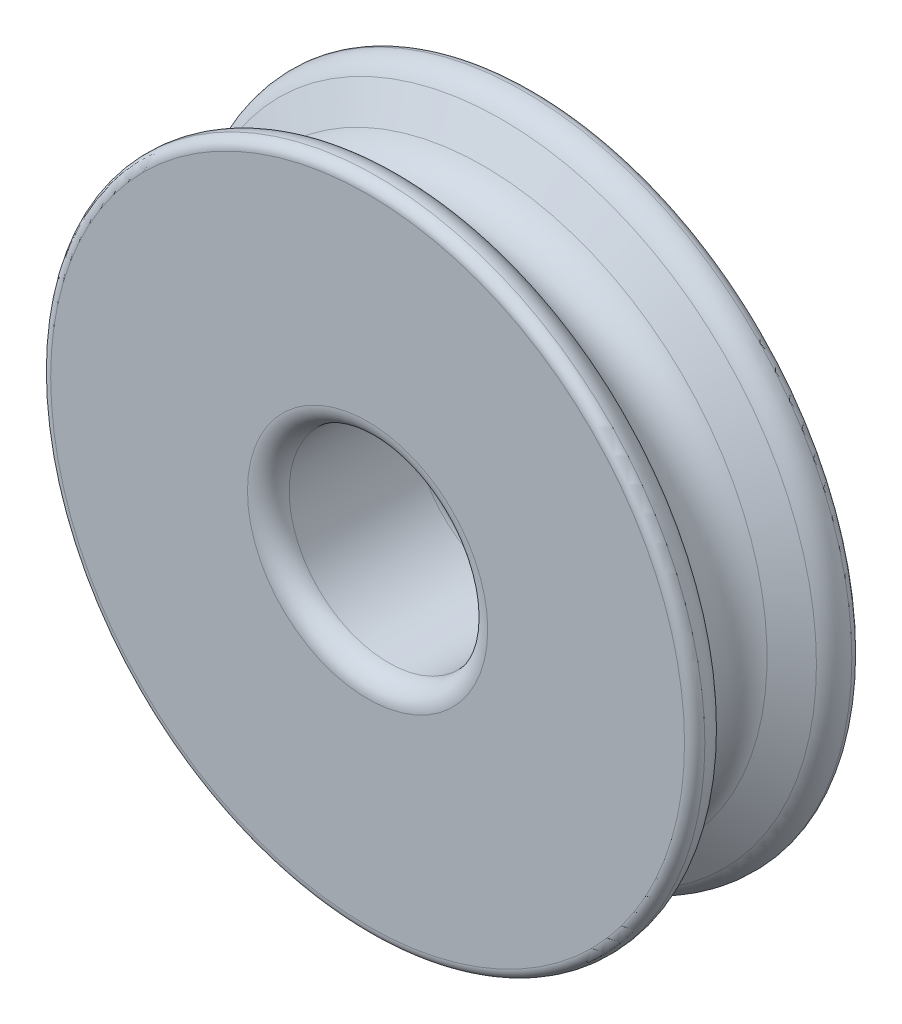
ISO-10303-21;
HEADER;
FILE_DESCRIPTION(('STEP AP214'),'2;1');
FILE_NAME('part.step','',(''),(''),'','','');
FILE_SCHEMA(('AUTOMOTIVE_DESIGN { 1 0 10303 214 1 1 1 1 }'));
ENDSEC;
DATA;
#1=APPLICATION_CONTEXT('core data for automotive mechanical design processes');
#2=APPLICATION_PROTOCOL_DEFINITION('international standard','automotive_design',2000,#1);
#3=PRODUCT_CONTEXT('',#1,'mechanical');
#4=PRODUCT('Part','Part','',(#3));
#5=PRODUCT_RELATED_PRODUCT_CATEGORY('part','',(#4));
#6=PRODUCT_DEFINITION_FORMATION('','',#4);
#7=PRODUCT_DEFINITION_CONTEXT('part definition',#1,'design');
#8=PRODUCT_DEFINITION('design','',#6,#7);
#9=PRODUCT_DEFINITION_SHAPE('','',#8);
#10=(LENGTH_UNIT() NAMED_UNIT(*) SI_UNIT(.MILLI.,.METRE.));
#11=(NAMED_UNIT(*) PLANE_ANGLE_UNIT() SI_UNIT($,.RADIAN.));
#12=(NAMED_UNIT(*) SI_UNIT($,.STERADIAN.) SOLID_ANGLE_UNIT());
#13=UNCERTAINTY_MEASURE_WITH_UNIT(LENGTH_MEASURE(1.E-05),#10,'distance_accuracy_value','');
#14=(GEOMETRIC_REPRESENTATION_CONTEXT(3) GLOBAL_UNCERTAINTY_ASSIGNED_CONTEXT((#13)) GLOBAL_UNIT_ASSIGNED_CONTEXT((#10,
#11,#12)) REPRESENTATION_CONTEXT('',''));
#15=CARTESIAN_POINT('',(0.,0.,0.));
#16=DIRECTION('',(0.,0.,1.));
#17=DIRECTION('',(1.,0.,0.));
#18=AXIS2_PLACEMENT_3D('',#15,#16,#17);
#19=CARTESIAN_POINT('',(0.,0.,-3.5));
#20=DIRECTION('',(0.,0.,-1.));
#21=DIRECTION('',(-1.,0.,0.));
#22=AXIS2_PLACEMENT_3D('',#19,#20,#21);
#23=TOROIDAL_SURFACE('',#22,15.2006264756117,0.499999999999999);
#24=CARTESIAN_POINT('',(0.,0.,-3.52502165342211));
#25=DIRECTION('',(0.,0.,-1.));
#26=DIRECTION('',(-1.,0.,0.));
#27=AXIS2_PLACEMENT_3D('',#24,#25,#26);
#28=CIRCLE('',#27,15.7);
#29=CARTESIAN_POINT('',(-15.7,0.,-3.52502165342211));
#30=VERTEX_POINT('',#29);
#31=EDGE_CURVE('E50',#30,#30,#28,.T.);
#32=ORIENTED_EDGE('',*,*,#31,.T.);
#33=EDGE_LOOP('',(#32));
#34=FACE_BOUND('',#33,.T.);
#35=CARTESIAN_POINT('',(0.,0.,-4.));
#36=DIRECTION('',(0.,0.,-1.));
#37=DIRECTION('',(-1.,0.,0.));
#38=AXIS2_PLACEMENT_3D('',#35,#36,#37);
#39=CIRCLE('',#38,15.2006264756117);
#40=CARTESIAN_POINT('',(-15.2006264756117,0.,-4.));
#41=VERTEX_POINT('',#40);
#42=EDGE_CURVE('E71',#41,#41,#39,.T.);
#43=ORIENTED_EDGE('',*,*,#42,.F.);
#44=EDGE_LOOP('',(#43));
#45=FACE_BOUND('',#44,.T.);
#46=ADVANCED_FACE('F30',(#34,#45),#23,.T.);
#47=CARTESIAN_POINT('',(0.,0.,-3.46496968520905));
#48=DIRECTION('',(0.,0.,-1.));
#49=DIRECTION('',(-1.,0.,0.));
#50=AXIS2_PLACEMENT_3D('',#47,#48,#49);
#51=TOROIDAL_SURFACE('',#50,14.501503541468,1.2);
#52=CARTESIAN_POINT('',(0.,0.,-2.42573920066772));
#53=DIRECTION('',(0.,0.,-1.));
#54=DIRECTION('',(-1.,0.,0.));
#55=AXIS2_PLACEMENT_3D('',#52,#53,#54);
#56=CIRCLE('',#55,15.101503541468);
#57=CARTESIAN_POINT('',(-15.101503541468,0.,-2.42573920066772));
#58=VERTEX_POINT('',#57);
#59=EDGE_CURVE('E53',#58,#58,#56,.T.);
#60=ORIENTED_EDGE('',*,*,#59,.T.);
#61=EDGE_LOOP('',(#60));
#62=FACE_BOUND('',#61,.T.);
#63=ORIENTED_EDGE('',*,*,#31,.F.);
#64=EDGE_LOOP('',(#63));
#65=FACE_BOUND('',#64,.T.);
#66=ADVANCED_FACE('F78',(#62,#65),#51,.T.);
#67=CARTESIAN_POINT('',(0.,0.,-2.42573920066772));
#68=DIRECTION('',(0.,0.,-1.));
#69=DIRECTION('',(-1.,0.,0.));
#70=AXIS2_PLACEMENT_3D('',#67,#68,#69);
#71=CONICAL_SURFACE('',#70,15.101503541468,1.0471975511966);
#72=CARTESIAN_POINT('',(0.,0.,-1.55884572681199));
#73=DIRECTION('',(0.,0.,-1.));
#74=DIRECTION('',(-1.,0.,0.));
#75=AXIS2_PLACEMENT_3D('',#72,#73,#74);
#76=CIRCLE('',#75,13.6);
#77=CARTESIAN_POINT('',(-13.6,0.,-1.55884572681199));
#78=VERTEX_POINT('',#77);
#79=EDGE_CURVE('E56',#78,#78,#76,.T.);
#80=ORIENTED_EDGE('',*,*,#79,.T.);
#81=EDGE_LOOP('',(#80));
#82=FACE_BOUND('',#81,.T.);
#83=ORIENTED_EDGE('',*,*,#59,.F.);
#84=EDGE_LOOP('',(#83));
#85=FACE_BOUND('',#84,.T.);
#86=ADVANCED_FACE('F84',(#82,#85),#71,.T.);
#87=CARTESIAN_POINT('',(0.,0.,0.));
#88=DIRECTION('',(0.,0.,-1.));
#89=DIRECTION('',(-1.,0.,0.));
#90=AXIS2_PLACEMENT_3D('',#87,#88,#89);
#91=TOROIDAL_SURFACE('',#90,14.5,1.8);
#92=CARTESIAN_POINT('',(0.,0.,1.55884572681199));
#93=DIRECTION('',(0.,0.,-1.));
#94=DIRECTION('',(-1.,0.,0.));
#95=AXIS2_PLACEMENT_3D('',#92,#93,#94);
#96=CIRCLE('',#95,13.6);
#97=CARTESIAN_POINT('',(-13.6,0.,1.55884572681199));
#98=VERTEX_POINT('',#97);
#99=EDGE_CURVE('E59',#98,#98,#96,.T.);
#100=ORIENTED_EDGE('',*,*,#99,.T.);
#101=EDGE_LOOP('',(#100));
#102=FACE_BOUND('',#101,.T.);
#103=ORIENTED_EDGE('',*,*,#79,.F.);
#104=EDGE_LOOP('',(#103));
#105=FACE_BOUND('',#104,.T.);
#106=ADVANCED_FACE('F120',(#102,#105),#91,.F.);
#107=CARTESIAN_POINT('',(0.,0.,1.55884572681199));
#108=DIRECTION('',(0.,0.,1.));
#109=DIRECTION('',(1.,0.,0.));
#110=AXIS2_PLACEMENT_3D('',#107,#108,#109);
#111=CONICAL_SURFACE('',#110,13.6,1.0471975511966);
#112=CARTESIAN_POINT('',(0.,0.,2.42573920066772));
#113=DIRECTION('',(0.,0.,-1.));
#114=DIRECTION('',(-1.,0.,0.));
#115=AXIS2_PLACEMENT_3D('',#112,#113,#114);
#116=CIRCLE('',#115,15.101503541468);
#117=CARTESIAN_POINT('',(-15.101503541468,0.,2.42573920066772));
#118=VERTEX_POINT('',#117);
#119=EDGE_CURVE('E62',#118,#118,#116,.T.);
#120=ORIENTED_EDGE('',*,*,#119,.T.);
#121=EDGE_LOOP('',(#120));
#122=FACE_BOUND('',#121,.T.);
#123=ORIENTED_EDGE('',*,*,#99,.F.);
#124=EDGE_LOOP('',(#123));
#125=FACE_BOUND('',#124,.T.);
#126=ADVANCED_FACE('F116',(#122,#125),#111,.T.);
#127=CARTESIAN_POINT('',(0.,0.,3.46496968520905));
#128=DIRECTION('',(0.,0.,-1.));
#129=DIRECTION('',(-1.,0.,0.));
#130=AXIS2_PLACEMENT_3D('',#127,#128,#129);
#131=TOROIDAL_SURFACE('',#130,14.501503541468,1.2);
#132=CARTESIAN_POINT('',(0.,0.,3.52502165342211));
#133=DIRECTION('',(0.,0.,-1.));
#134=DIRECTION('',(-1.,0.,0.));
#135=AXIS2_PLACEMENT_3D('',#132,#133,#134);
#136=CIRCLE('',#135,15.7);
#137=CARTESIAN_POINT('',(-15.7,0.,3.52502165342211));
#138=VERTEX_POINT('',#137);
#139=EDGE_CURVE('E65',#138,#138,#136,.T.);
#140=ORIENTED_EDGE('',*,*,#139,.T.);
#141=EDGE_LOOP('',(#140));
#142=FACE_BOUND('',#141,.T.);
#143=ORIENTED_EDGE('',*,*,#119,.F.);
#144=EDGE_LOOP('',(#143));
#145=FACE_BOUND('',#144,.T.);
#146=ADVANCED_FACE('F112',(#142,#145),#131,.T.);
#147=CARTESIAN_POINT('',(0.,0.,3.5));
#148=DIRECTION('',(0.,0.,-1.));
#149=DIRECTION('',(-1.,0.,0.));
#150=AXIS2_PLACEMENT_3D('',#147,#148,#149);
#151=TOROIDAL_SURFACE('',#150,15.2006264756117,0.499999999999999);
#152=CARTESIAN_POINT('',(0.,0.,4.));
#153=DIRECTION('',(0.,0.,-1.));
#154=DIRECTION('',(-1.,0.,0.));
#155=AXIS2_PLACEMENT_3D('',#152,#153,#154);
#156=CIRCLE('',#155,15.2006264756117);
#157=CARTESIAN_POINT('',(-15.2006264756117,0.,4.));
#158=VERTEX_POINT('',#157);
#159=EDGE_CURVE('E68',#158,#158,#156,.T.);
#160=ORIENTED_EDGE('',*,*,#159,.T.);
#161=EDGE_LOOP('',(#160));
#162=FACE_BOUND('',#161,.T.);
#163=ORIENTED_EDGE('',*,*,#139,.F.);
#164=EDGE_LOOP('',(#163));
#165=FACE_BOUND('',#164,.T.);
#166=ADVANCED_FACE('F107',(#162,#165),#151,.T.);
#167=CARTESIAN_POINT('',(0.,0.,4.));
#168=DIRECTION('',(0.,0.,1.));
#169=DIRECTION('',(1.,0.,0.));
#170=AXIS2_PLACEMENT_3D('',#167,#168,#169);
#171=PLANE('',#170);
#172=CARTESIAN_POINT('',(0.,0.,4.));
#173=DIRECTION('',(0.,0.,1.));
#174=DIRECTION('',(1.,0.,0.));
#175=AXIS2_PLACEMENT_3D('',#172,#173,#174);
#176=CIRCLE('',#175,5.7625);
#177=CARTESIAN_POINT('',(5.7625,0.,4.));
#178=VERTEX_POINT('',#177);
#179=EDGE_CURVE('E10',#178,#178,#176,.F.);
#180=ORIENTED_EDGE('',*,*,#179,.T.);
#181=EDGE_LOOP('',(#180));
#182=FACE_BOUND('',#181,.T.);
#183=ORIENTED_EDGE('',*,*,#159,.F.);
#184=EDGE_LOOP('',(#183));
#185=FACE_BOUND('',#184,.T.);
#186=ADVANCED_FACE('F102',(#182,#185),#171,.T.);
#187=CARTESIAN_POINT('',(0.,0.,-4.));
#188=DIRECTION('',(0.,0.,-1.));
#189=DIRECTION('',(-1.,0.,0.));
#190=AXIS2_PLACEMENT_3D('',#187,#188,#189);
#191=PLANE('',#190);
#192=CARTESIAN_POINT('',(0.,0.,-4.));
#193=DIRECTION('',(0.,0.,-1.));
#194=DIRECTION('',(-1.,0.,0.));
#195=AXIS2_PLACEMENT_3D('',#192,#193,#194);
#196=CIRCLE('',#195,5.7625);
#197=CARTESIAN_POINT('',(-5.7625,0.,-4.));
#198=VERTEX_POINT('',#197);
#199=EDGE_CURVE('E45',#198,#198,#196,.F.);
#200=ORIENTED_EDGE('',*,*,#199,.T.);
#201=EDGE_LOOP('',(#200));
#202=FACE_BOUND('',#201,.T.);
#203=ORIENTED_EDGE('',*,*,#42,.T.);
#204=EDGE_LOOP('',(#203));
#205=FACE_BOUND('',#204,.T.);
#206=ADVANCED_FACE('F75',(#202,#205),#191,.T.);
#207=CARTESIAN_POINT('',(0.,0.,-4.));
#208=DIRECTION('',(0.,0.,1.));
#209=DIRECTION('',(1.,0.,0.));
#210=AXIS2_PLACEMENT_3D('',#207,#208,#209);
#211=CYLINDRICAL_SURFACE('',#210,4.7625);
#212=CARTESIAN_POINT('',(0.,0.,-3.));
#213=DIRECTION('',(0.,0.,-1.));
#214=DIRECTION('',(-1.,0.,0.));
#215=AXIS2_PLACEMENT_3D('',#212,#213,#214);
#216=CIRCLE('',#215,4.7625);
#217=CARTESIAN_POINT('',(-4.7625,0.,-3.));
#218=VERTEX_POINT('',#217);
#219=EDGE_CURVE('E37',#218,#218,#216,.T.);
#220=ORIENTED_EDGE('',*,*,#219,.T.);
#221=EDGE_LOOP('',(#220));
#222=FACE_BOUND('',#221,.T.);
#223=CARTESIAN_POINT('',(0.,0.,3.));
#224=DIRECTION('',(0.,0.,1.));
#225=DIRECTION('',(1.,0.,0.));
#226=AXIS2_PLACEMENT_3D('',#223,#224,#225);
#227=CIRCLE('',#226,4.7625);
#228=CARTESIAN_POINT('',(4.7625,0.,3.));
#229=VERTEX_POINT('',#228);
#230=EDGE_CURVE('E41',#229,#229,#227,.T.);
#231=ORIENTED_EDGE('',*,*,#230,.T.);
#232=EDGE_LOOP('',(#231));
#233=FACE_BOUND('',#232,.T.);
#234=ADVANCED_FACE('F90',(#222,#233),#211,.F.);
#235=CARTESIAN_POINT('',(0.,0.,-3.));
#236=DIRECTION('',(0.,0.,-1.));
#237=DIRECTION('',(-1.,0.,0.));
#238=AXIS2_PLACEMENT_3D('',#235,#236,#237);
#239=TOROIDAL_SURFACE('',#238,5.7625,1.);
#240=ORIENTED_EDGE('',*,*,#219,.F.);
#241=EDGE_LOOP('',(#240));
#242=FACE_BOUND('',#241,.T.);
#243=ORIENTED_EDGE('',*,*,#199,.F.);
#244=EDGE_LOOP('',(#243));
#245=FACE_BOUND('',#244,.T.);
#246=ADVANCED_FACE('F88',(#242,#245),#239,.T.);
#247=CARTESIAN_POINT('',(0.,0.,3.));
#248=DIRECTION('',(0.,0.,1.));
#249=DIRECTION('',(1.,0.,0.));
#250=AXIS2_PLACEMENT_3D('',#247,#248,#249);
#251=TOROIDAL_SURFACE('',#250,5.7625,1.);
#252=ORIENTED_EDGE('',*,*,#179,.F.);
#253=EDGE_LOOP('',(#252));
#254=FACE_BOUND('',#253,.T.);
#255=ORIENTED_EDGE('',*,*,#230,.F.);
#256=EDGE_LOOP('',(#255));
#257=FACE_BOUND('',#256,.T.);
#258=ADVANCED_FACE('F32',(#254,#257),#251,.T.);
#259=CLOSED_SHELL('',(#46,#66,#86,#106,#126,#146,#166,#186,#206,#234,#246,#258));
#260=MANIFOLD_SOLID_BREP('B2',#259);
#261=ADVANCED_BREP_SHAPE_REPRESENTATION('',(#18,#260),#14);
#262=SHAPE_DEFINITION_REPRESENTATION(#9,#261);
ENDSEC;
END-ISO-10303-21;
